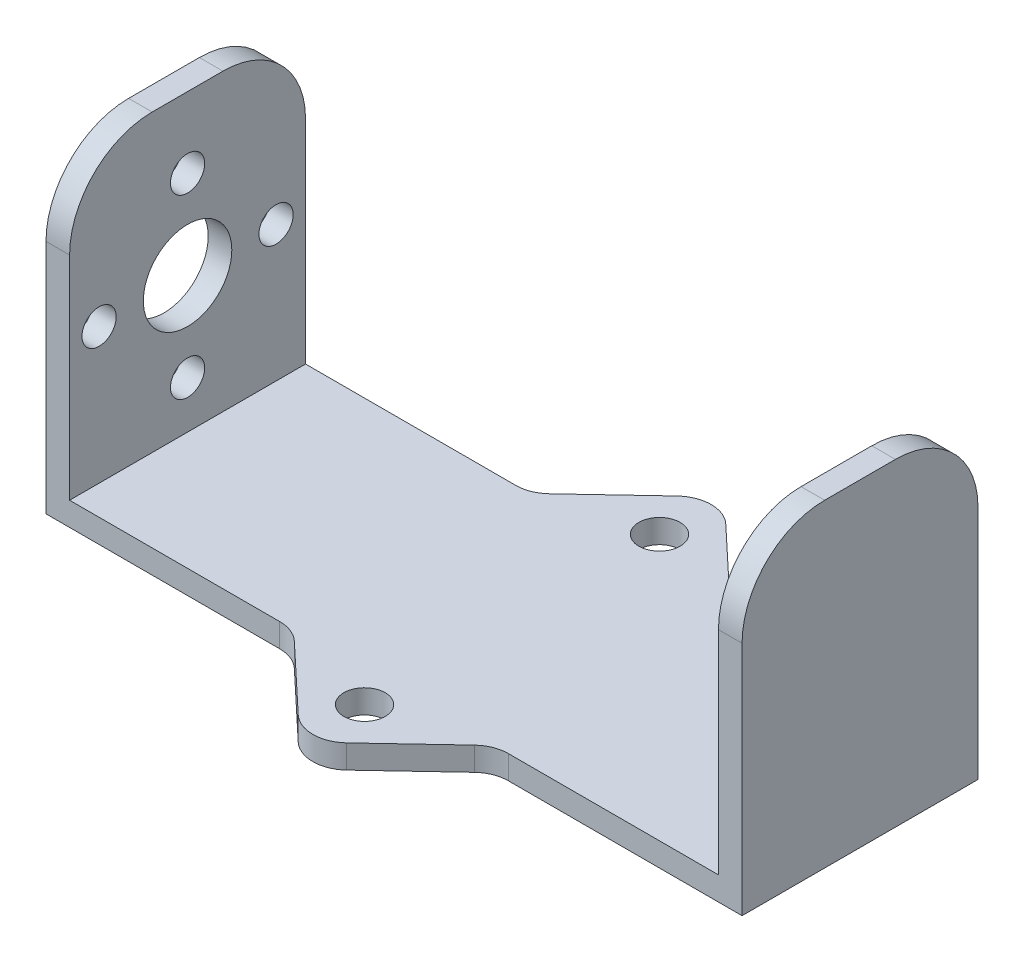
ISO-10303-21;
HEADER;
FILE_DESCRIPTION(('STEP AP214'),'2;1');
FILE_NAME('part.step','',(''),(''),'','','');
FILE_SCHEMA(('AUTOMOTIVE_DESIGN { 1 0 10303 214 1 1 1 1 }'));
ENDSEC;
DATA;
#1=APPLICATION_CONTEXT('core data for automotive mechanical design processes');
#2=APPLICATION_PROTOCOL_DEFINITION('international standard','automotive_design',2000,#1);
#3=PRODUCT_CONTEXT('',#1,'mechanical');
#4=PRODUCT('Part','Part','',(#3));
#5=PRODUCT_RELATED_PRODUCT_CATEGORY('part','',(#4));
#6=PRODUCT_DEFINITION_FORMATION('','',#4);
#7=PRODUCT_DEFINITION_CONTEXT('part definition',#1,'design');
#8=PRODUCT_DEFINITION('design','',#6,#7);
#9=PRODUCT_DEFINITION_SHAPE('','',#8);
#10=(LENGTH_UNIT() NAMED_UNIT(*) SI_UNIT(.MILLI.,.METRE.));
#11=(NAMED_UNIT(*) PLANE_ANGLE_UNIT() SI_UNIT($,.RADIAN.));
#12=(NAMED_UNIT(*) SI_UNIT($,.STERADIAN.) SOLID_ANGLE_UNIT());
#13=UNCERTAINTY_MEASURE_WITH_UNIT(LENGTH_MEASURE(1.E-05),#10,'distance_accuracy_value','');
#14=(GEOMETRIC_REPRESENTATION_CONTEXT(3) GLOBAL_UNCERTAINTY_ASSIGNED_CONTEXT((#13)) GLOBAL_UNIT_ASSIGNED_CONTEXT((#10,
#11,#12)) REPRESENTATION_CONTEXT('',''));
#15=CARTESIAN_POINT('',(0.,0.,0.));
#16=DIRECTION('',(0.,0.,1.));
#17=DIRECTION('',(1.,0.,0.));
#18=AXIS2_PLACEMENT_3D('',#15,#16,#17);
#19=CARTESIAN_POINT('',(0.,0.,10.));
#20=DIRECTION('',(0.,0.,-1.));
#21=DIRECTION('',(-1.,0.,0.));
#22=AXIS2_PLACEMENT_3D('',#19,#20,#21);
#23=PLANE('',#22);
#24=DIRECTION('',(-1.,0.,0.));
#25=VECTOR('',#24,1.);
#26=CARTESIAN_POINT('',(-27.5,0.,10.));
#27=LINE('',#26,#25);
#28=CARTESIAN_POINT('',(27.5,0.,10.));
#29=VERTEX_POINT('',#28);
#30=CARTESIAN_POINT('',(9.68973157372328,0.,10.));
#31=VERTEX_POINT('',#30);
#32=EDGE_CURVE('E230',#29,#31,#27,.T.);
#33=ORIENTED_EDGE('',*,*,#32,.T.);
#34=DIRECTION('',(0.,1.,0.));
#35=VECTOR('',#34,1.);
#36=CARTESIAN_POINT('',(9.68973157372328,0.,10.));
#37=LINE('',#36,#35);
#38=CARTESIAN_POINT('',(9.68973157372329,-2.,10.));
#39=VERTEX_POINT('',#38);
#40=EDGE_CURVE('E328',#31,#39,#37,.F.);
#41=ORIENTED_EDGE('',*,*,#40,.T.);
#42=DIRECTION('',(1.,0.,0.));
#43=VECTOR('',#42,1.);
#44=CARTESIAN_POINT('',(29.5,-1.99999999999999,10.));
#45=LINE('',#44,#43);
#46=CARTESIAN_POINT('',(29.5,-1.99999999999999,10.));
#47=VERTEX_POINT('',#46);
#48=EDGE_CURVE('E205',#39,#47,#45,.T.);
#49=ORIENTED_EDGE('',*,*,#48,.T.);
#50=DIRECTION('',(0.,1.,0.));
#51=VECTOR('',#50,1.);
#52=CARTESIAN_POINT('',(29.5,-1.99999999999999,10.));
#53=LINE('',#52,#51);
#54=CARTESIAN_POINT('',(29.5,18.,10.));
#55=VERTEX_POINT('',#54);
#56=EDGE_CURVE('E221',#47,#55,#53,.T.);
#57=ORIENTED_EDGE('',*,*,#56,.T.);
#58=DIRECTION('',(-1.,0.,0.));
#59=VECTOR('',#58,1.);
#60=CARTESIAN_POINT('',(0.,18.,10.));
#61=LINE('',#60,#59);
#62=CARTESIAN_POINT('',(27.5,18.,10.));
#63=VERTEX_POINT('',#62);
#64=EDGE_CURVE('E287',#55,#63,#61,.T.);
#65=ORIENTED_EDGE('',*,*,#64,.T.);
#66=DIRECTION('',(0.,-1.,0.));
#67=VECTOR('',#66,1.);
#68=CARTESIAN_POINT('',(27.5,25.,10.));
#69=LINE('',#68,#67);
#70=EDGE_CURVE('E224',#63,#29,#69,.T.);
#71=ORIENTED_EDGE('',*,*,#70,.T.);
#72=EDGE_LOOP('',(#33,#41,#49,#57,#65,#71));
#73=FACE_BOUND('',#72,.T.);
#74=ADVANCED_FACE('F33',(#73),#23,.F.);
#75=CARTESIAN_POINT('',(0.,0.,-10.));
#76=DIRECTION('',(0.,0.,-1.));
#77=DIRECTION('',(-1.,0.,0.));
#78=AXIS2_PLACEMENT_3D('',#75,#76,#77);
#79=PLANE('',#78);
#80=DIRECTION('',(-1.,0.,0.));
#81=VECTOR('',#80,1.);
#82=CARTESIAN_POINT('',(-27.5,0.,-10.));
#83=LINE('',#82,#81);
#84=CARTESIAN_POINT('',(-9.68973157372328,0.,-10.));
#85=VERTEX_POINT('',#84);
#86=CARTESIAN_POINT('',(-27.5,0.,-10.));
#87=VERTEX_POINT('',#86);
#88=EDGE_CURVE('E246',#85,#87,#83,.T.);
#89=ORIENTED_EDGE('',*,*,#88,.F.);
#90=DIRECTION('',(0.,1.,0.));
#91=VECTOR('',#90,1.);
#92=CARTESIAN_POINT('',(-9.68973157372328,-2.00000000000001,-10.));
#93=LINE('',#92,#91);
#94=CARTESIAN_POINT('',(-9.68973157372327,-2.,-10.));
#95=VERTEX_POINT('',#94);
#96=EDGE_CURVE('E358',#85,#95,#93,.F.);
#97=ORIENTED_EDGE('',*,*,#96,.T.);
#98=DIRECTION('',(1.,0.,0.));
#99=VECTOR('',#98,1.);
#100=CARTESIAN_POINT('',(29.5,-1.99999999999999,-10.));
#101=LINE('',#100,#99);
#102=CARTESIAN_POINT('',(-29.5,-2.,-10.));
#103=VERTEX_POINT('',#102);
#104=EDGE_CURVE('E239',#103,#95,#101,.T.);
#105=ORIENTED_EDGE('',*,*,#104,.F.);
#106=DIRECTION('',(0.,-1.,0.));
#107=VECTOR('',#106,1.);
#108=CARTESIAN_POINT('',(-29.5,-2.,-10.));
#109=LINE('',#108,#107);
#110=CARTESIAN_POINT('',(-29.5,18.,-10.));
#111=VERTEX_POINT('',#110);
#112=EDGE_CURVE('E213',#111,#103,#109,.T.);
#113=ORIENTED_EDGE('',*,*,#112,.F.);
#114=DIRECTION('',(-1.,0.,0.));
#115=VECTOR('',#114,1.);
#116=CARTESIAN_POINT('',(-27.5,18.,-10.));
#117=LINE('',#116,#115);
#118=CARTESIAN_POINT('',(-27.5,18.,-10.));
#119=VERTEX_POINT('',#118);
#120=EDGE_CURVE('E278',#111,#119,#117,.F.);
#121=ORIENTED_EDGE('',*,*,#120,.T.);
#122=DIRECTION('',(0.,1.,0.));
#123=VECTOR('',#122,1.);
#124=CARTESIAN_POINT('',(-27.5,25.,-10.));
#125=LINE('',#124,#123);
#126=EDGE_CURVE('E206',#87,#119,#125,.T.);
#127=ORIENTED_EDGE('',*,*,#126,.F.);
#128=EDGE_LOOP('',(#89,#97,#105,#113,#121,#127));
#129=FACE_BOUND('',#128,.T.);
#130=ADVANCED_FACE('F382',(#129),#79,.T.);
#131=CARTESIAN_POINT('',(-29.5,25.,10.));
#132=DIRECTION('',(0.,-1.,0.));
#133=DIRECTION('',(0.,0.,-1.));
#134=AXIS2_PLACEMENT_3D('',#131,#132,#133);
#135=PLANE('',#134);
#136=DIRECTION('',(0.,0.,-1.));
#137=VECTOR('',#136,1.);
#138=CARTESIAN_POINT('',(-27.5,25.,10.));
#139=LINE('',#138,#137);
#140=CARTESIAN_POINT('',(-27.5,25.,3.));
#141=VERTEX_POINT('',#140);
#142=CARTESIAN_POINT('',(-27.5,25.,-3.));
#143=VERTEX_POINT('',#142);
#144=EDGE_CURVE('E235',#141,#143,#139,.T.);
#145=ORIENTED_EDGE('',*,*,#144,.T.);
#146=DIRECTION('',(-1.,0.,0.));
#147=VECTOR('',#146,1.);
#148=CARTESIAN_POINT('',(-29.5,25.,-3.));
#149=LINE('',#148,#147);
#150=CARTESIAN_POINT('',(-29.5,25.,-3.));
#151=VERTEX_POINT('',#150);
#152=EDGE_CURVE('E292',#143,#151,#149,.T.);
#153=ORIENTED_EDGE('',*,*,#152,.T.);
#154=DIRECTION('',(0.,0.,-1.));
#155=VECTOR('',#154,1.);
#156=CARTESIAN_POINT('',(-29.5,25.,10.));
#157=LINE('',#156,#155);
#158=CARTESIAN_POINT('',(-29.5,25.,3.));
#159=VERTEX_POINT('',#158);
#160=EDGE_CURVE('E216',#159,#151,#157,.T.);
#161=ORIENTED_EDGE('',*,*,#160,.F.);
#162=DIRECTION('',(-1.,0.,0.));
#163=VECTOR('',#162,1.);
#164=CARTESIAN_POINT('',(-29.5,25.,3.));
#165=LINE('',#164,#163);
#166=EDGE_CURVE('E290',#159,#141,#165,.F.);
#167=ORIENTED_EDGE('',*,*,#166,.T.);
#168=EDGE_LOOP('',(#145,#153,#161,#167));
#169=FACE_BOUND('',#168,.T.);
#170=ADVANCED_FACE('F436',(#169),#135,.F.);
#171=CARTESIAN_POINT('',(-29.5,-2.,10.));
#172=DIRECTION('',(1.,0.,0.));
#173=DIRECTION('',(0.,0.,-1.));
#174=AXIS2_PLACEMENT_3D('',#171,#172,#173);
#175=PLANE('',#174);
#176=CARTESIAN_POINT('',(-29.5,11.5,0.));
#177=DIRECTION('',(1.,0.,0.));
#178=DIRECTION('',(0.,0.,-1.));
#179=AXIS2_PLACEMENT_3D('',#176,#177,#178);
#180=CIRCLE('',#179,3.75);
#181=CARTESIAN_POINT('',(-29.5,11.5,-3.75));
#182=VERTEX_POINT('',#181);
#183=EDGE_CURVE('E319',#182,#182,#180,.T.);
#184=ORIENTED_EDGE('',*,*,#183,.T.);
#185=EDGE_LOOP('',(#184));
#186=FACE_BOUND('',#185,.T.);
#187=CARTESIAN_POINT('',(-29.5,11.5,7.5));
#188=DIRECTION('',(1.,0.,0.));
#189=DIRECTION('',(0.,0.,-1.));
#190=AXIS2_PLACEMENT_3D('',#187,#188,#189);
#191=CIRCLE('',#190,1.45);
#192=CARTESIAN_POINT('',(-29.5,11.5,6.05));
#193=VERTEX_POINT('',#192);
#194=EDGE_CURVE('E315',#193,#193,#191,.T.);
#195=ORIENTED_EDGE('',*,*,#194,.T.);
#196=EDGE_LOOP('',(#195));
#197=FACE_BOUND('',#196,.T.);
#198=CARTESIAN_POINT('',(-29.5,4.,0.));
#199=DIRECTION('',(1.,0.,0.));
#200=DIRECTION('',(0.,0.,-1.));
#201=AXIS2_PLACEMENT_3D('',#198,#199,#200);
#202=CIRCLE('',#201,1.45);
#203=CARTESIAN_POINT('',(-29.5,4.,-1.45));
#204=VERTEX_POINT('',#203);
#205=EDGE_CURVE('E311',#204,#204,#202,.T.);
#206=ORIENTED_EDGE('',*,*,#205,.T.);
#207=EDGE_LOOP('',(#206));
#208=FACE_BOUND('',#207,.T.);
#209=CARTESIAN_POINT('',(-29.5,11.5,-7.5));
#210=DIRECTION('',(1.,0.,0.));
#211=DIRECTION('',(0.,0.,-1.));
#212=AXIS2_PLACEMENT_3D('',#209,#210,#211);
#213=CIRCLE('',#212,1.45);
#214=CARTESIAN_POINT('',(-29.5,11.5,-8.95));
#215=VERTEX_POINT('',#214);
#216=EDGE_CURVE('E307',#215,#215,#213,.T.);
#217=ORIENTED_EDGE('',*,*,#216,.T.);
#218=EDGE_LOOP('',(#217));
#219=FACE_BOUND('',#218,.T.);
#220=CARTESIAN_POINT('',(-29.5,19.,0.));
#221=DIRECTION('',(1.,0.,0.));
#222=DIRECTION('',(0.,0.,-1.));
#223=AXIS2_PLACEMENT_3D('',#220,#221,#222);
#224=CIRCLE('',#223,1.45);
#225=CARTESIAN_POINT('',(-29.5,19.,-1.45));
#226=VERTEX_POINT('',#225);
#227=EDGE_CURVE('E238',#226,#226,#224,.T.);
#228=ORIENTED_EDGE('',*,*,#227,.T.);
#229=EDGE_LOOP('',(#228));
#230=FACE_BOUND('',#229,.T.);
#231=ORIENTED_EDGE('',*,*,#160,.T.);
#232=CARTESIAN_POINT('',(-29.5,18.,-3.));
#233=DIRECTION('',(1.,0.,0.));
#234=DIRECTION('',(0.,0.,-1.));
#235=AXIS2_PLACEMENT_3D('',#232,#233,#234);
#236=CIRCLE('',#235,7.);
#237=EDGE_CURVE('E297',#151,#111,#236,.F.);
#238=ORIENTED_EDGE('',*,*,#237,.T.);
#239=ORIENTED_EDGE('',*,*,#112,.T.);
#240=DIRECTION('',(0.,0.,-1.));
#241=VECTOR('',#240,1.);
#242=CARTESIAN_POINT('',(-29.5,-2.,10.));
#243=LINE('',#242,#241);
#244=CARTESIAN_POINT('',(-29.5,-2.,10.));
#245=VERTEX_POINT('',#244);
#246=EDGE_CURVE('E209',#245,#103,#243,.T.);
#247=ORIENTED_EDGE('',*,*,#246,.F.);
#248=DIRECTION('',(0.,-1.,0.));
#249=VECTOR('',#248,1.);
#250=CARTESIAN_POINT('',(-29.5,-2.,10.));
#251=LINE('',#250,#249);
#252=CARTESIAN_POINT('',(-29.5,18.,10.));
#253=VERTEX_POINT('',#252);
#254=EDGE_CURVE('E195',#253,#245,#251,.T.);
#255=ORIENTED_EDGE('',*,*,#254,.F.);
#256=CARTESIAN_POINT('',(-29.5,18.,3.));
#257=DIRECTION('',(1.,0.,0.));
#258=DIRECTION('',(0.,0.,-1.));
#259=AXIS2_PLACEMENT_3D('',#256,#257,#258);
#260=CIRCLE('',#259,7.);
#261=EDGE_CURVE('E295',#253,#159,#260,.F.);
#262=ORIENTED_EDGE('',*,*,#261,.T.);
#263=EDGE_LOOP('',(#231,#238,#239,#247,#255,#262));
#264=FACE_BOUND('',#263,.T.);
#265=ADVANCED_FACE('F211',(#186,#197,#208,#219,#230,#264),#175,.F.);
#266=CARTESIAN_POINT('',(29.5,-1.99999999999999,10.));
#267=DIRECTION('',(0.,1.,0.));
#268=DIRECTION('',(-1.,0.,0.));
#269=AXIS2_PLACEMENT_3D('',#266,#267,#268);
#270=PLANE('',#269);
#271=CARTESIAN_POINT('',(0.,-2.,12.5));
#272=DIRECTION('',(0.,1.,0.));
#273=DIRECTION('',(-1.,0.,0.));
#274=AXIS2_PLACEMENT_3D('',#271,#272,#273);
#275=CIRCLE('',#274,1.75);
#276=CARTESIAN_POINT('',(-1.75,-2.,12.5));
#277=VERTEX_POINT('',#276);
#278=EDGE_CURVE('E549',#277,#277,#275,.T.);
#279=ORIENTED_EDGE('',*,*,#278,.T.);
#280=EDGE_LOOP('',(#279));
#281=FACE_BOUND('',#280,.T.);
#282=CARTESIAN_POINT('',(0.,-2.,-12.5));
#283=DIRECTION('',(0.,1.,0.));
#284=DIRECTION('',(-1.,0.,0.));
#285=AXIS2_PLACEMENT_3D('',#282,#283,#284);
#286=CIRCLE('',#285,1.75);
#287=CARTESIAN_POINT('',(-1.75,-2.,-12.5));
#288=VERTEX_POINT('',#287);
#289=EDGE_CURVE('E540',#288,#288,#286,.T.);
#290=ORIENTED_EDGE('',*,*,#289,.T.);
#291=EDGE_LOOP('',(#290));
#292=FACE_BOUND('',#291,.T.);
#293=DIRECTION('',(-0.728199992692803,0.,0.685364699004991));
#294=VECTOR('',#293,1.);
#295=CARTESIAN_POINT('',(0.,-2.,18.));
#296=LINE('',#295,#294);
#297=CARTESIAN_POINT('',(7.63363747670831,-2.,10.8154000219216));
#298=VERTEX_POINT('',#297);
#299=CARTESIAN_POINT('',(2.05609409701497,-2.,16.0648526145741));
#300=VERTEX_POINT('',#299);
#301=EDGE_CURVE('E400',#298,#300,#296,.T.);
#302=ORIENTED_EDGE('',*,*,#301,.T.);
#303=CARTESIAN_POINT('',(0.,-2.,13.8802526364957));
#304=DIRECTION('',(0.,1.,0.));
#305=DIRECTION('',(-1.,0.,0.));
#306=AXIS2_PLACEMENT_3D('',#303,#304,#305);
#307=CIRCLE('',#306,3.);
#308=CARTESIAN_POINT('',(-2.05609409701497,-2.,16.0648526145741));
#309=VERTEX_POINT('',#308);
#310=EDGE_CURVE('E341',#300,#309,#307,.F.);
#311=ORIENTED_EDGE('',*,*,#310,.T.);
#312=DIRECTION('',(-0.728199992692803,0.,-0.685364699004991));
#313=VECTOR('',#312,1.);
#314=CARTESIAN_POINT('',(-8.5,-2.,9.99999999999999));
#315=LINE('',#314,#313);
#316=CARTESIAN_POINT('',(-7.6336374767083,-2.,10.8154000219216));
#317=VERTEX_POINT('',#316);
#318=EDGE_CURVE('E541',#309,#317,#315,.T.);
#319=ORIENTED_EDGE('',*,*,#318,.T.);
#320=CARTESIAN_POINT('',(-9.68973157372328,-2.,13.));
#321=DIRECTION('',(0.,1.,0.));
#322=DIRECTION('',(-1.,0.,0.));
#323=AXIS2_PLACEMENT_3D('',#320,#321,#322);
#324=CIRCLE('',#323,3.);
#325=CARTESIAN_POINT('',(-9.68973157372327,-2.,10.));
#326=VERTEX_POINT('',#325);
#327=EDGE_CURVE('E48',#317,#326,#324,.T.);
#328=ORIENTED_EDGE('',*,*,#327,.T.);
#329=EDGE_CURVE('E199',#245,#326,#45,.T.);
#330=ORIENTED_EDGE('',*,*,#329,.F.);
#331=ORIENTED_EDGE('',*,*,#246,.T.);
#332=ORIENTED_EDGE('',*,*,#104,.T.);
#333=CARTESIAN_POINT('',(-9.68973157372328,-2.,-13.));
#334=DIRECTION('',(0.,1.,0.));
#335=DIRECTION('',(-1.,0.,0.));
#336=AXIS2_PLACEMENT_3D('',#333,#334,#335);
#337=CIRCLE('',#336,3.);
#338=CARTESIAN_POINT('',(-7.6336374767083,-2.,-10.8154000219216));
#339=VERTEX_POINT('',#338);
#340=EDGE_CURVE('E11',#95,#339,#337,.T.);
#341=ORIENTED_EDGE('',*,*,#340,.T.);
#342=DIRECTION('',(0.728199992692803,0.,-0.685364699004991));
#343=VECTOR('',#342,1.);
#344=CARTESIAN_POINT('',(-8.5,-2.,-9.99999999999999));
#345=LINE('',#344,#343);
#346=CARTESIAN_POINT('',(-2.05609409701497,-2.,-16.0648526145741));
#347=VERTEX_POINT('',#346);
#348=EDGE_CURVE('E386',#339,#347,#345,.T.);
#349=ORIENTED_EDGE('',*,*,#348,.T.);
#350=CARTESIAN_POINT('',(0.,-2.,-13.8802526364957));
#351=DIRECTION('',(0.,1.,0.));
#352=DIRECTION('',(-1.,0.,0.));
#353=AXIS2_PLACEMENT_3D('',#350,#351,#352);
#354=CIRCLE('',#353,3.);
#355=CARTESIAN_POINT('',(2.05609409701497,-2.,-16.0648526145741));
#356=VERTEX_POINT('',#355);
#357=EDGE_CURVE('E339',#347,#356,#354,.F.);
#358=ORIENTED_EDGE('',*,*,#357,.T.);
#359=DIRECTION('',(0.728199992692803,0.,0.685364699004991));
#360=VECTOR('',#359,1.);
#361=CARTESIAN_POINT('',(0.,-2.,-18.));
#362=LINE('',#361,#360);
#363=CARTESIAN_POINT('',(7.63363747670831,-2.,-10.8154000219216));
#364=VERTEX_POINT('',#363);
#365=EDGE_CURVE('E323',#356,#364,#362,.T.);
#366=ORIENTED_EDGE('',*,*,#365,.T.);
#367=CARTESIAN_POINT('',(9.68973157372328,-2.,-13.));
#368=DIRECTION('',(0.,1.,0.));
#369=DIRECTION('',(-1.,0.,0.));
#370=AXIS2_PLACEMENT_3D('',#367,#368,#369);
#371=CIRCLE('',#370,3.);
#372=CARTESIAN_POINT('',(9.68973157372329,-2.,-10.));
#373=VERTEX_POINT('',#372);
#374=EDGE_CURVE('E55',#364,#373,#371,.T.);
#375=ORIENTED_EDGE('',*,*,#374,.T.);
#376=CARTESIAN_POINT('',(29.5,-1.99999999999999,-10.));
#377=VERTEX_POINT('',#376);
#378=EDGE_CURVE('E237',#373,#377,#101,.T.);
#379=ORIENTED_EDGE('',*,*,#378,.T.);
#380=DIRECTION('',(0.,0.,-1.));
#381=VECTOR('',#380,1.);
#382=CARTESIAN_POINT('',(29.5,-1.99999999999999,10.));
#383=LINE('',#382,#381);
#384=EDGE_CURVE('E217',#47,#377,#383,.T.);
#385=ORIENTED_EDGE('',*,*,#384,.F.);
#386=ORIENTED_EDGE('',*,*,#48,.F.);
#387=CARTESIAN_POINT('',(9.68973157372328,-2.,13.));
#388=DIRECTION('',(0.,1.,0.));
#389=DIRECTION('',(-1.,0.,0.));
#390=AXIS2_PLACEMENT_3D('',#387,#388,#389);
#391=CIRCLE('',#390,3.);
#392=EDGE_CURVE('E362',#39,#298,#391,.T.);
#393=ORIENTED_EDGE('',*,*,#392,.T.);
#394=EDGE_LOOP('',(#302,#311,#319,#328,#330,#331,#332,#341,#349,#358,#366,#375,#379,#385,#386,#393));
#395=FACE_BOUND('',#394,.T.);
#396=ADVANCED_FACE('F220',(#281,#292,#395),#270,.F.);
#397=CARTESIAN_POINT('',(29.5,-1.99999999999999,10.));
#398=DIRECTION('',(-1.,0.,0.));
#399=DIRECTION('',(0.,-1.,0.));
#400=AXIS2_PLACEMENT_3D('',#397,#398,#399);
#401=PLANE('',#400);
#402=DIRECTION('',(0.,1.,0.));
#403=VECTOR('',#402,1.);
#404=CARTESIAN_POINT('',(29.5,-1.99999999999999,-10.));
#405=LINE('',#404,#403);
#406=CARTESIAN_POINT('',(29.5,18.,-10.));
#407=VERTEX_POINT('',#406);
#408=EDGE_CURVE('E241',#377,#407,#405,.T.);
#409=ORIENTED_EDGE('',*,*,#408,.T.);
#410=CARTESIAN_POINT('',(29.5,18.,-3.));
#411=DIRECTION('',(-1.,0.,0.));
#412=DIRECTION('',(0.,-1.,0.));
#413=AXIS2_PLACEMENT_3D('',#410,#411,#412);
#414=CIRCLE('',#413,7.);
#415=CARTESIAN_POINT('',(29.5,25.,-3.));
#416=VERTEX_POINT('',#415);
#417=EDGE_CURVE('E284',#407,#416,#414,.F.);
#418=ORIENTED_EDGE('',*,*,#417,.T.);
#419=DIRECTION('',(0.,0.,-1.));
#420=VECTOR('',#419,1.);
#421=CARTESIAN_POINT('',(29.5,25.,10.));
#422=LINE('',#421,#420);
#423=CARTESIAN_POINT('',(29.5,25.,3.));
#424=VERTEX_POINT('',#423);
#425=EDGE_CURVE('E263',#424,#416,#422,.T.);
#426=ORIENTED_EDGE('',*,*,#425,.F.);
#427=CARTESIAN_POINT('',(29.5,18.,3.));
#428=DIRECTION('',(-1.,0.,0.));
#429=DIRECTION('',(0.,-1.,0.));
#430=AXIS2_PLACEMENT_3D('',#427,#428,#429);
#431=CIRCLE('',#430,7.);
#432=EDGE_CURVE('E282',#424,#55,#431,.F.);
#433=ORIENTED_EDGE('',*,*,#432,.T.);
#434=ORIENTED_EDGE('',*,*,#56,.F.);
#435=ORIENTED_EDGE('',*,*,#384,.T.);
#436=EDGE_LOOP('',(#409,#418,#426,#433,#434,#435));
#437=FACE_BOUND('',#436,.T.);
#438=ADVANCED_FACE('F463',(#437),#401,.F.);
#439=CARTESIAN_POINT('',(29.5,25.,10.));
#440=DIRECTION('',(0.,-1.,0.));
#441=DIRECTION('',(0.,0.,-1.));
#442=AXIS2_PLACEMENT_3D('',#439,#440,#441);
#443=PLANE('',#442);
#444=ORIENTED_EDGE('',*,*,#425,.T.);
#445=DIRECTION('',(-1.,0.,0.));
#446=VECTOR('',#445,1.);
#447=CARTESIAN_POINT('',(27.5,25.,-3.));
#448=LINE('',#447,#446);
#449=CARTESIAN_POINT('',(27.5,25.,-3.));
#450=VERTEX_POINT('',#449);
#451=EDGE_CURVE('E271',#416,#450,#448,.T.);
#452=ORIENTED_EDGE('',*,*,#451,.T.);
#453=DIRECTION('',(0.,0.,-1.));
#454=VECTOR('',#453,1.);
#455=CARTESIAN_POINT('',(27.5,25.,10.));
#456=LINE('',#455,#454);
#457=CARTESIAN_POINT('',(27.5,25.,3.));
#458=VERTEX_POINT('',#457);
#459=EDGE_CURVE('E260',#458,#450,#456,.T.);
#460=ORIENTED_EDGE('',*,*,#459,.F.);
#461=DIRECTION('',(-1.,0.,0.));
#462=VECTOR('',#461,1.);
#463=CARTESIAN_POINT('',(29.5,25.,3.));
#464=LINE('',#463,#462);
#465=EDGE_CURVE('E269',#458,#424,#464,.F.);
#466=ORIENTED_EDGE('',*,*,#465,.T.);
#467=EDGE_LOOP('',(#444,#452,#460,#466));
#468=FACE_BOUND('',#467,.T.);
#469=ADVANCED_FACE('F459',(#468),#443,.F.);
#470=CARTESIAN_POINT('',(27.5,25.,10.));
#471=DIRECTION('',(1.,0.,0.));
#472=DIRECTION('',(0.,1.,0.));
#473=AXIS2_PLACEMENT_3D('',#470,#471,#472);
#474=PLANE('',#473);
#475=ORIENTED_EDGE('',*,*,#459,.T.);
#476=CARTESIAN_POINT('',(27.5,18.,-3.));
#477=DIRECTION('',(1.,0.,0.));
#478=DIRECTION('',(0.,1.,0.));
#479=AXIS2_PLACEMENT_3D('',#476,#477,#478);
#480=CIRCLE('',#479,7.);
#481=CARTESIAN_POINT('',(27.5,18.,-10.));
#482=VERTEX_POINT('',#481);
#483=EDGE_CURVE('E276',#450,#482,#480,.F.);
#484=ORIENTED_EDGE('',*,*,#483,.T.);
#485=DIRECTION('',(0.,-1.,0.));
#486=VECTOR('',#485,1.);
#487=CARTESIAN_POINT('',(27.5,25.,-10.));
#488=LINE('',#487,#486);
#489=CARTESIAN_POINT('',(27.5,0.,-10.));
#490=VERTEX_POINT('',#489);
#491=EDGE_CURVE('E244',#482,#490,#488,.T.);
#492=ORIENTED_EDGE('',*,*,#491,.T.);
#493=DIRECTION('',(0.,0.,-1.));
#494=VECTOR('',#493,1.);
#495=CARTESIAN_POINT('',(27.5,0.,10.));
#496=LINE('',#495,#494);
#497=EDGE_CURVE('E257',#29,#490,#496,.T.);
#498=ORIENTED_EDGE('',*,*,#497,.F.);
#499=ORIENTED_EDGE('',*,*,#70,.F.);
#500=CARTESIAN_POINT('',(27.5,18.,3.));
#501=DIRECTION('',(1.,0.,0.));
#502=DIRECTION('',(0.,1.,0.));
#503=AXIS2_PLACEMENT_3D('',#500,#501,#502);
#504=CIRCLE('',#503,7.);
#505=EDGE_CURVE('E274',#63,#458,#504,.F.);
#506=ORIENTED_EDGE('',*,*,#505,.T.);
#507=EDGE_LOOP('',(#475,#484,#492,#498,#499,#506));
#508=FACE_BOUND('',#507,.T.);
#509=ADVANCED_FACE('F452',(#508),#474,.F.);
#510=CARTESIAN_POINT('',(-27.5,0.,10.));
#511=DIRECTION('',(0.,-1.,0.));
#512=DIRECTION('',(1.,0.,0.));
#513=AXIS2_PLACEMENT_3D('',#510,#511,#512);
#514=PLANE('',#513);
#515=CARTESIAN_POINT('',(0.,0.,12.5));
#516=DIRECTION('',(0.,1.,0.));
#517=DIRECTION('',(-1.,0.,0.));
#518=AXIS2_PLACEMENT_3D('',#515,#516,#517);
#519=CIRCLE('',#518,1.75);
#520=CARTESIAN_POINT('',(-1.75,0.,12.5));
#521=VERTEX_POINT('',#520);
#522=EDGE_CURVE('E551',#521,#521,#519,.T.);
#523=ORIENTED_EDGE('',*,*,#522,.F.);
#524=EDGE_LOOP('',(#523));
#525=FACE_BOUND('',#524,.T.);
#526=CARTESIAN_POINT('',(0.,0.,-12.5));
#527=DIRECTION('',(0.,1.,0.));
#528=DIRECTION('',(-1.,0.,0.));
#529=AXIS2_PLACEMENT_3D('',#526,#527,#528);
#530=CIRCLE('',#529,1.75);
#531=CARTESIAN_POINT('',(-1.75,0.,-12.5));
#532=VERTEX_POINT('',#531);
#533=EDGE_CURVE('E543',#532,#532,#530,.T.);
#534=ORIENTED_EDGE('',*,*,#533,.F.);
#535=EDGE_LOOP('',(#534));
#536=FACE_BOUND('',#535,.T.);
#537=DIRECTION('',(0.728199992692803,0.,0.685364699004991));
#538=VECTOR('',#537,1.);
#539=CARTESIAN_POINT('',(-8.5,0.,10.));
#540=LINE('',#539,#538);
#541=CARTESIAN_POINT('',(-7.6336374767083,0.,10.8154000219216));
#542=VERTEX_POINT('',#541);
#543=CARTESIAN_POINT('',(-2.05609409701498,0.,16.0648526145741));
#544=VERTEX_POINT('',#543);
#545=EDGE_CURVE('E397',#542,#544,#540,.T.);
#546=ORIENTED_EDGE('',*,*,#545,.T.);
#547=CARTESIAN_POINT('',(0.,0.,13.8802526364957));
#548=DIRECTION('',(0.,-1.,0.));
#549=DIRECTION('',(1.,0.,0.));
#550=AXIS2_PLACEMENT_3D('',#547,#548,#549);
#551=CIRCLE('',#550,3.);
#552=CARTESIAN_POINT('',(2.05609409701497,0.,16.0648526145741));
#553=VERTEX_POINT('',#552);
#554=EDGE_CURVE('E337',#544,#553,#551,.F.);
#555=ORIENTED_EDGE('',*,*,#554,.T.);
#556=DIRECTION('',(0.728199992692803,0.,-0.685364699004991));
#557=VECTOR('',#556,1.);
#558=CARTESIAN_POINT('',(0.,0.,18.));
#559=LINE('',#558,#557);
#560=CARTESIAN_POINT('',(7.63363747670831,0.,10.8154000219216));
#561=VERTEX_POINT('',#560);
#562=EDGE_CURVE('E538',#553,#561,#559,.T.);
#563=ORIENTED_EDGE('',*,*,#562,.T.);
#564=CARTESIAN_POINT('',(9.68973157372328,0.,13.));
#565=DIRECTION('',(0.,-1.,0.));
#566=DIRECTION('',(1.,0.,0.));
#567=AXIS2_PLACEMENT_3D('',#564,#565,#566);
#568=CIRCLE('',#567,3.);
#569=EDGE_CURVE('E360',#561,#31,#568,.T.);
#570=ORIENTED_EDGE('',*,*,#569,.T.);
#571=ORIENTED_EDGE('',*,*,#32,.F.);
#572=ORIENTED_EDGE('',*,*,#497,.T.);
#573=CARTESIAN_POINT('',(9.68973157372328,0.,-10.));
#574=VERTEX_POINT('',#573);
#575=EDGE_CURVE('E247',#490,#574,#83,.T.);
#576=ORIENTED_EDGE('',*,*,#575,.T.);
#577=CARTESIAN_POINT('',(9.68973157372328,0.,-13.));
#578=DIRECTION('',(0.,-1.,0.));
#579=DIRECTION('',(1.,0.,0.));
#580=AXIS2_PLACEMENT_3D('',#577,#578,#579);
#581=CIRCLE('',#580,3.);
#582=CARTESIAN_POINT('',(7.63363747670831,0.,-10.8154000219216));
#583=VERTEX_POINT('',#582);
#584=EDGE_CURVE('E367',#574,#583,#581,.T.);
#585=ORIENTED_EDGE('',*,*,#584,.T.);
#586=DIRECTION('',(-0.728199992692803,0.,-0.685364699004991));
#587=VECTOR('',#586,1.);
#588=CARTESIAN_POINT('',(0.,0.,-18.));
#589=LINE('',#588,#587);
#590=CARTESIAN_POINT('',(2.05609409701497,0.,-16.0648526145741));
#591=VERTEX_POINT('',#590);
#592=EDGE_CURVE('E393',#583,#591,#589,.T.);
#593=ORIENTED_EDGE('',*,*,#592,.T.);
#594=CARTESIAN_POINT('',(0.,0.,-13.8802526364957));
#595=DIRECTION('',(0.,-1.,0.));
#596=DIRECTION('',(1.,0.,0.));
#597=AXIS2_PLACEMENT_3D('',#594,#595,#596);
#598=CIRCLE('',#597,3.);
#599=CARTESIAN_POINT('',(-2.05609409701497,0.,-16.0648526145741));
#600=VERTEX_POINT('',#599);
#601=EDGE_CURVE('E335',#591,#600,#598,.F.);
#602=ORIENTED_EDGE('',*,*,#601,.T.);
#603=DIRECTION('',(-0.728199992692803,0.,0.685364699004991));
#604=VECTOR('',#603,1.);
#605=CARTESIAN_POINT('',(-8.5,0.,-10.));
#606=LINE('',#605,#604);
#607=CARTESIAN_POINT('',(-7.6336374767083,0.,-10.8154000219216));
#608=VERTEX_POINT('',#607);
#609=EDGE_CURVE('E376',#600,#608,#606,.T.);
#610=ORIENTED_EDGE('',*,*,#609,.T.);
#611=CARTESIAN_POINT('',(-9.68973157372328,0.,-13.));
#612=DIRECTION('',(0.,-1.,0.));
#613=DIRECTION('',(1.,0.,0.));
#614=AXIS2_PLACEMENT_3D('',#611,#612,#613);
#615=CIRCLE('',#614,3.);
#616=EDGE_CURVE('E41',#608,#85,#615,.T.);
#617=ORIENTED_EDGE('',*,*,#616,.T.);
#618=ORIENTED_EDGE('',*,*,#88,.T.);
#619=DIRECTION('',(0.,0.,-1.));
#620=VECTOR('',#619,1.);
#621=CARTESIAN_POINT('',(-27.5,0.,10.));
#622=LINE('',#621,#620);
#623=CARTESIAN_POINT('',(-27.5,0.,10.));
#624=VERTEX_POINT('',#623);
#625=EDGE_CURVE('E254',#624,#87,#622,.T.);
#626=ORIENTED_EDGE('',*,*,#625,.F.);
#627=CARTESIAN_POINT('',(-9.68973157372328,0.,10.));
#628=VERTEX_POINT('',#627);
#629=EDGE_CURVE('E229',#628,#624,#27,.T.);
#630=ORIENTED_EDGE('',*,*,#629,.F.);
#631=CARTESIAN_POINT('',(-9.68973157372328,0.,13.));
#632=DIRECTION('',(0.,-1.,0.));
#633=DIRECTION('',(1.,0.,0.));
#634=AXIS2_PLACEMENT_3D('',#631,#632,#633);
#635=CIRCLE('',#634,3.);
#636=EDGE_CURVE('E364',#628,#542,#635,.T.);
#637=ORIENTED_EDGE('',*,*,#636,.T.);
#638=EDGE_LOOP('',(#546,#555,#563,#570,#571,#572,#576,#585,#593,#602,#610,#617,#618,#626,#630,#637));
#639=FACE_BOUND('',#638,.T.);
#640=ADVANCED_FACE('F373',(#525,#536,#639),#514,.F.);
#641=CARTESIAN_POINT('',(-27.5,25.,10.));
#642=DIRECTION('',(-1.,0.,0.));
#643=DIRECTION('',(0.,-1.,0.));
#644=AXIS2_PLACEMENT_3D('',#641,#642,#643);
#645=PLANE('',#644);
#646=CARTESIAN_POINT('',(-27.5,11.5,0.));
#647=DIRECTION('',(-1.,0.,0.));
#648=DIRECTION('',(0.,-1.,0.));
#649=AXIS2_PLACEMENT_3D('',#646,#647,#648);
#650=CIRCLE('',#649,3.75);
#651=CARTESIAN_POINT('',(-27.5,7.75,0.));
#652=VERTEX_POINT('',#651);
#653=EDGE_CURVE('E320',#652,#652,#650,.T.);
#654=ORIENTED_EDGE('',*,*,#653,.T.);
#655=EDGE_LOOP('',(#654));
#656=FACE_BOUND('',#655,.T.);
#657=CARTESIAN_POINT('',(-27.5,11.5,7.5));
#658=DIRECTION('',(-1.,0.,0.));
#659=DIRECTION('',(0.,-1.,0.));
#660=AXIS2_PLACEMENT_3D('',#657,#658,#659);
#661=CIRCLE('',#660,1.45);
#662=CARTESIAN_POINT('',(-27.5,10.05,7.5));
#663=VERTEX_POINT('',#662);
#664=EDGE_CURVE('E316',#663,#663,#661,.T.);
#665=ORIENTED_EDGE('',*,*,#664,.T.);
#666=EDGE_LOOP('',(#665));
#667=FACE_BOUND('',#666,.T.);
#668=CARTESIAN_POINT('',(-27.5,4.,0.));
#669=DIRECTION('',(-1.,0.,0.));
#670=DIRECTION('',(0.,-1.,0.));
#671=AXIS2_PLACEMENT_3D('',#668,#669,#670);
#672=CIRCLE('',#671,1.45);
#673=CARTESIAN_POINT('',(-27.5,2.55,0.));
#674=VERTEX_POINT('',#673);
#675=EDGE_CURVE('E312',#674,#674,#672,.T.);
#676=ORIENTED_EDGE('',*,*,#675,.T.);
#677=EDGE_LOOP('',(#676));
#678=FACE_BOUND('',#677,.T.);
#679=CARTESIAN_POINT('',(-27.5,11.5,-7.5));
#680=DIRECTION('',(-1.,0.,0.));
#681=DIRECTION('',(0.,-1.,0.));
#682=AXIS2_PLACEMENT_3D('',#679,#680,#681);
#683=CIRCLE('',#682,1.45);
#684=CARTESIAN_POINT('',(-27.5,10.05,-7.5));
#685=VERTEX_POINT('',#684);
#686=EDGE_CURVE('E308',#685,#685,#683,.T.);
#687=ORIENTED_EDGE('',*,*,#686,.T.);
#688=EDGE_LOOP('',(#687));
#689=FACE_BOUND('',#688,.T.);
#690=CARTESIAN_POINT('',(-27.5,19.,0.));
#691=DIRECTION('',(-1.,0.,0.));
#692=DIRECTION('',(0.,-1.,0.));
#693=AXIS2_PLACEMENT_3D('',#690,#691,#692);
#694=CIRCLE('',#693,1.45);
#695=CARTESIAN_POINT('',(-27.5,17.55,0.));
#696=VERTEX_POINT('',#695);
#697=EDGE_CURVE('E304',#696,#696,#694,.T.);
#698=ORIENTED_EDGE('',*,*,#697,.T.);
#699=EDGE_LOOP('',(#698));
#700=FACE_BOUND('',#699,.T.);
#701=ORIENTED_EDGE('',*,*,#126,.T.);
#702=CARTESIAN_POINT('',(-27.5,18.,-3.));
#703=DIRECTION('',(-1.,0.,0.));
#704=DIRECTION('',(0.,-1.,0.));
#705=AXIS2_PLACEMENT_3D('',#702,#703,#704);
#706=CIRCLE('',#705,7.);
#707=EDGE_CURVE('E301',#119,#143,#706,.F.);
#708=ORIENTED_EDGE('',*,*,#707,.T.);
#709=ORIENTED_EDGE('',*,*,#144,.F.);
#710=CARTESIAN_POINT('',(-27.5,18.,3.));
#711=DIRECTION('',(-1.,0.,0.));
#712=DIRECTION('',(0.,-1.,0.));
#713=AXIS2_PLACEMENT_3D('',#710,#711,#712);
#714=CIRCLE('',#713,7.);
#715=CARTESIAN_POINT('',(-27.5,18.,10.));
#716=VERTEX_POINT('',#715);
#717=EDGE_CURVE('E299',#141,#716,#714,.F.);
#718=ORIENTED_EDGE('',*,*,#717,.T.);
#719=DIRECTION('',(0.,1.,0.));
#720=VECTOR('',#719,1.);
#721=CARTESIAN_POINT('',(-27.5,25.,10.));
#722=LINE('',#721,#720);
#723=EDGE_CURVE('E233',#624,#716,#722,.T.);
#724=ORIENTED_EDGE('',*,*,#723,.F.);
#725=ORIENTED_EDGE('',*,*,#625,.T.);
#726=EDGE_LOOP('',(#701,#708,#709,#718,#724,#725));
#727=FACE_BOUND('',#726,.T.);
#728=ADVANCED_FACE('F440',(#656,#667,#678,#689,#700,#727),#645,.F.);
#729=ORIENTED_EDGE('',*,*,#329,.T.);
#730=DIRECTION('',(0.,1.,0.));
#731=VECTOR('',#730,1.);
#732=CARTESIAN_POINT('',(-9.68973157372328,0.,10.));
#733=LINE('',#732,#731);
#734=EDGE_CURVE('E343',#326,#628,#733,.T.);
#735=ORIENTED_EDGE('',*,*,#734,.T.);
#736=ORIENTED_EDGE('',*,*,#629,.T.);
#737=ORIENTED_EDGE('',*,*,#723,.T.);
#738=DIRECTION('',(-1.,0.,0.));
#739=VECTOR('',#738,1.);
#740=CARTESIAN_POINT('',(0.,18.,10.));
#741=LINE('',#740,#739);
#742=EDGE_CURVE('E203',#716,#253,#741,.T.);
#743=ORIENTED_EDGE('',*,*,#742,.T.);
#744=ORIENTED_EDGE('',*,*,#254,.T.);
#745=EDGE_LOOP('',(#729,#735,#736,#737,#743,#744));
#746=FACE_BOUND('',#745,.T.);
#747=ADVANCED_FACE('F197',(#746),#23,.F.);
#748=ORIENTED_EDGE('',*,*,#378,.F.);
#749=DIRECTION('',(0.,1.,0.));
#750=VECTOR('',#749,1.);
#751=CARTESIAN_POINT('',(9.68973157372328,0.,-10.));
#752=LINE('',#751,#750);
#753=EDGE_CURVE('E355',#373,#574,#752,.T.);
#754=ORIENTED_EDGE('',*,*,#753,.T.);
#755=ORIENTED_EDGE('',*,*,#575,.F.);
#756=ORIENTED_EDGE('',*,*,#491,.F.);
#757=DIRECTION('',(-1.,0.,0.));
#758=VECTOR('',#757,1.);
#759=CARTESIAN_POINT('',(29.5,18.,-10.));
#760=LINE('',#759,#758);
#761=EDGE_CURVE('E280',#482,#407,#760,.F.);
#762=ORIENTED_EDGE('',*,*,#761,.T.);
#763=ORIENTED_EDGE('',*,*,#408,.F.);
#764=EDGE_LOOP('',(#748,#754,#755,#756,#762,#763));
#765=FACE_BOUND('',#764,.T.);
#766=ADVANCED_FACE('F438',(#765),#79,.T.);
#767=CARTESIAN_POINT('',(29.5,18.,-3.));
#768=DIRECTION('',(1.,0.,0.));
#769=DIRECTION('',(0.,0.,-1.));
#770=AXIS2_PLACEMENT_3D('',#767,#768,#769);
#771=CYLINDRICAL_SURFACE('',#770,7.);
#772=ORIENTED_EDGE('',*,*,#417,.F.);
#773=ORIENTED_EDGE('',*,*,#761,.F.);
#774=ORIENTED_EDGE('',*,*,#483,.F.);
#775=ORIENTED_EDGE('',*,*,#451,.F.);
#776=EDGE_LOOP('',(#772,#773,#774,#775));
#777=FACE_BOUND('',#776,.T.);
#778=ADVANCED_FACE('F445',(#777),#771,.T.);
#779=CARTESIAN_POINT('',(0.,18.,3.));
#780=DIRECTION('',(-1.,0.,0.));
#781=DIRECTION('',(0.,0.,1.));
#782=AXIS2_PLACEMENT_3D('',#779,#780,#781);
#783=CYLINDRICAL_SURFACE('',#782,7.);
#784=ORIENTED_EDGE('',*,*,#432,.F.);
#785=ORIENTED_EDGE('',*,*,#465,.F.);
#786=ORIENTED_EDGE('',*,*,#505,.F.);
#787=ORIENTED_EDGE('',*,*,#64,.F.);
#788=EDGE_LOOP('',(#784,#785,#786,#787));
#789=FACE_BOUND('',#788,.T.);
#790=ADVANCED_FACE('F479',(#789),#783,.T.);
#791=CARTESIAN_POINT('',(-29.5,18.,-3.));
#792=DIRECTION('',(1.,0.,0.));
#793=DIRECTION('',(0.,0.,-1.));
#794=AXIS2_PLACEMENT_3D('',#791,#792,#793);
#795=CYLINDRICAL_SURFACE('',#794,7.);
#796=ORIENTED_EDGE('',*,*,#707,.F.);
#797=ORIENTED_EDGE('',*,*,#120,.F.);
#798=ORIENTED_EDGE('',*,*,#237,.F.);
#799=ORIENTED_EDGE('',*,*,#152,.F.);
#800=EDGE_LOOP('',(#796,#797,#798,#799));
#801=FACE_BOUND('',#800,.T.);
#802=ADVANCED_FACE('F426',(#801),#795,.T.);
#803=CARTESIAN_POINT('',(0.,18.,3.));
#804=DIRECTION('',(-1.,0.,0.));
#805=DIRECTION('',(0.,0.,1.));
#806=AXIS2_PLACEMENT_3D('',#803,#804,#805);
#807=CYLINDRICAL_SURFACE('',#806,7.);
#808=ORIENTED_EDGE('',*,*,#717,.F.);
#809=ORIENTED_EDGE('',*,*,#166,.F.);
#810=ORIENTED_EDGE('',*,*,#261,.F.);
#811=ORIENTED_EDGE('',*,*,#742,.F.);
#812=EDGE_LOOP('',(#808,#809,#810,#811));
#813=FACE_BOUND('',#812,.T.);
#814=ADVANCED_FACE('F416',(#813),#807,.T.);
#815=CARTESIAN_POINT('',(-42.5,19.,0.));
#816=DIRECTION('',(1.,0.,0.));
#817=DIRECTION('',(0.,1.,0.));
#818=AXIS2_PLACEMENT_3D('',#815,#816,#817);
#819=CYLINDRICAL_SURFACE('',#818,1.45);
#820=ORIENTED_EDGE('',*,*,#697,.F.);
#821=EDGE_LOOP('',(#820));
#822=FACE_BOUND('',#821,.T.);
#823=ORIENTED_EDGE('',*,*,#227,.F.);
#824=EDGE_LOOP('',(#823));
#825=FACE_BOUND('',#824,.T.);
#826=ADVANCED_FACE('F413',(#822,#825),#819,.F.);
#827=CARTESIAN_POINT('',(-42.5,11.5,-7.5));
#828=DIRECTION('',(1.,0.,0.));
#829=DIRECTION('',(0.,1.,0.));
#830=AXIS2_PLACEMENT_3D('',#827,#828,#829);
#831=CYLINDRICAL_SURFACE('',#830,1.45);
#832=ORIENTED_EDGE('',*,*,#686,.F.);
#833=EDGE_LOOP('',(#832));
#834=FACE_BOUND('',#833,.T.);
#835=ORIENTED_EDGE('',*,*,#216,.F.);
#836=EDGE_LOOP('',(#835));
#837=FACE_BOUND('',#836,.T.);
#838=ADVANCED_FACE('F415',(#834,#837),#831,.F.);
#839=CARTESIAN_POINT('',(-42.5,4.,0.));
#840=DIRECTION('',(1.,0.,0.));
#841=DIRECTION('',(0.,1.,0.));
#842=AXIS2_PLACEMENT_3D('',#839,#840,#841);
#843=CYLINDRICAL_SURFACE('',#842,1.45);
#844=ORIENTED_EDGE('',*,*,#675,.F.);
#845=EDGE_LOOP('',(#844));
#846=FACE_BOUND('',#845,.T.);
#847=ORIENTED_EDGE('',*,*,#205,.F.);
#848=EDGE_LOOP('',(#847));
#849=FACE_BOUND('',#848,.T.);
#850=ADVANCED_FACE('F423',(#846,#849),#843,.F.);
#851=CARTESIAN_POINT('',(-42.5,11.5,7.5));
#852=DIRECTION('',(1.,0.,0.));
#853=DIRECTION('',(0.,1.,0.));
#854=AXIS2_PLACEMENT_3D('',#851,#852,#853);
#855=CYLINDRICAL_SURFACE('',#854,1.45);
#856=ORIENTED_EDGE('',*,*,#664,.F.);
#857=EDGE_LOOP('',(#856));
#858=FACE_BOUND('',#857,.T.);
#859=ORIENTED_EDGE('',*,*,#194,.F.);
#860=EDGE_LOOP('',(#859));
#861=FACE_BOUND('',#860,.T.);
#862=ADVANCED_FACE('F587',(#858,#861),#855,.F.);
#863=CARTESIAN_POINT('',(-42.5,11.5,0.));
#864=DIRECTION('',(1.,0.,0.));
#865=DIRECTION('',(0.,1.,0.));
#866=AXIS2_PLACEMENT_3D('',#863,#864,#865);
#867=CYLINDRICAL_SURFACE('',#866,3.75);
#868=ORIENTED_EDGE('',*,*,#653,.F.);
#869=EDGE_LOOP('',(#868));
#870=FACE_BOUND('',#869,.T.);
#871=ORIENTED_EDGE('',*,*,#183,.F.);
#872=EDGE_LOOP('',(#871));
#873=FACE_BOUND('',#872,.T.);
#874=ADVANCED_FACE('F581',(#870,#873),#867,.F.);
#875=CARTESIAN_POINT('',(-8.5,-20.7882942280559,-10.));
#876=DIRECTION('',(-0.685364699004991,0.,-0.728199992692803));
#877=DIRECTION('',(-0.728199992692803,0.,0.685364699004991));
#878=AXIS2_PLACEMENT_3D('',#875,#876,#877);
#879=PLANE('',#878);
#880=ORIENTED_EDGE('',*,*,#609,.F.);
#881=DIRECTION('',(0.,1.,0.));
#882=VECTOR('',#881,1.);
#883=CARTESIAN_POINT('',(-2.05609409701497,-20.7882942280559,-16.0648526145741));
#884=LINE('',#883,#882);
#885=EDGE_CURVE('E353',#600,#347,#884,.F.);
#886=ORIENTED_EDGE('',*,*,#885,.T.);
#887=ORIENTED_EDGE('',*,*,#348,.F.);
#888=DIRECTION('',(0.,1.,0.));
#889=VECTOR('',#888,1.);
#890=CARTESIAN_POINT('',(-7.6336374767083,0.,-10.8154000219216));
#891=LINE('',#890,#889);
#892=EDGE_CURVE('E350',#339,#608,#891,.T.);
#893=ORIENTED_EDGE('',*,*,#892,.T.);
#894=EDGE_LOOP('',(#880,#886,#887,#893));
#895=FACE_BOUND('',#894,.T.);
#896=ADVANCED_FACE('F389',(#895),#879,.T.);
#897=CARTESIAN_POINT('',(0.,-20.7882942280559,-18.));
#898=DIRECTION('',(0.685364699004991,0.,-0.728199992692803));
#899=DIRECTION('',(-0.728199992692803,0.,-0.685364699004991));
#900=AXIS2_PLACEMENT_3D('',#897,#898,#899);
#901=PLANE('',#900);
#902=ORIENTED_EDGE('',*,*,#365,.F.);
#903=DIRECTION('',(0.,1.,0.));
#904=VECTOR('',#903,1.);
#905=CARTESIAN_POINT('',(2.05609409701497,-20.7882942280559,-16.0648526145741));
#906=LINE('',#905,#904);
#907=EDGE_CURVE('E347',#356,#591,#906,.T.);
#908=ORIENTED_EDGE('',*,*,#907,.T.);
#909=ORIENTED_EDGE('',*,*,#592,.F.);
#910=DIRECTION('',(0.,1.,0.));
#911=VECTOR('',#910,1.);
#912=CARTESIAN_POINT('',(7.63363747670831,-2.,-10.8154000219216));
#913=LINE('',#912,#911);
#914=EDGE_CURVE('E345',#583,#364,#913,.F.);
#915=ORIENTED_EDGE('',*,*,#914,.T.);
#916=EDGE_LOOP('',(#902,#908,#909,#915));
#917=FACE_BOUND('',#916,.T.);
#918=ADVANCED_FACE('F578',(#917),#901,.T.);
#919=CARTESIAN_POINT('',(0.,-20.7882942280559,18.));
#920=DIRECTION('',(0.685364699004991,0.,0.728199992692803));
#921=DIRECTION('',(0.728199992692803,0.,-0.685364699004991));
#922=AXIS2_PLACEMENT_3D('',#919,#920,#921);
#923=PLANE('',#922);
#924=ORIENTED_EDGE('',*,*,#301,.F.);
#925=DIRECTION('',(0.,1.,0.));
#926=VECTOR('',#925,1.);
#927=CARTESIAN_POINT('',(7.63363747670831,-20.7882942280559,10.8154000219216));
#928=LINE('',#927,#926);
#929=EDGE_CURVE('E325',#298,#561,#928,.T.);
#930=ORIENTED_EDGE('',*,*,#929,.T.);
#931=ORIENTED_EDGE('',*,*,#562,.F.);
#932=DIRECTION('',(0.,1.,0.));
#933=VECTOR('',#932,1.);
#934=CARTESIAN_POINT('',(2.05609409701497,-20.7882942280559,16.0648526145741));
#935=LINE('',#934,#933);
#936=EDGE_CURVE('E303',#553,#300,#935,.F.);
#937=ORIENTED_EDGE('',*,*,#936,.T.);
#938=EDGE_LOOP('',(#924,#930,#931,#937));
#939=FACE_BOUND('',#938,.T.);
#940=ADVANCED_FACE('F537',(#939),#923,.T.);
#941=CARTESIAN_POINT('',(-8.5,-20.7882942280559,10.));
#942=DIRECTION('',(-0.685364699004991,0.,0.728199992692803));
#943=DIRECTION('',(0.728199992692803,0.,0.685364699004991));
#944=AXIS2_PLACEMENT_3D('',#941,#942,#943);
#945=PLANE('',#944);
#946=ORIENTED_EDGE('',*,*,#318,.F.);
#947=DIRECTION('',(0.,1.,0.));
#948=VECTOR('',#947,1.);
#949=CARTESIAN_POINT('',(-2.05609409701498,-20.7882942280559,16.0648526145741));
#950=LINE('',#949,#948);
#951=EDGE_CURVE('E332',#309,#544,#950,.T.);
#952=ORIENTED_EDGE('',*,*,#951,.T.);
#953=ORIENTED_EDGE('',*,*,#545,.F.);
#954=DIRECTION('',(0.,1.,0.));
#955=VECTOR('',#954,1.);
#956=CARTESIAN_POINT('',(-7.6336374767083,-20.7882942280559,10.8154000219216));
#957=LINE('',#956,#955);
#958=EDGE_CURVE('E330',#542,#317,#957,.F.);
#959=ORIENTED_EDGE('',*,*,#958,.T.);
#960=EDGE_LOOP('',(#946,#952,#953,#959));
#961=FACE_BOUND('',#960,.T.);
#962=ADVANCED_FACE('F491',(#961),#945,.T.);
#963=CARTESIAN_POINT('',(9.68973157372328,-20.7882942280559,13.));
#964=DIRECTION('',(0.,1.,0.));
#965=DIRECTION('',(-1.,0.,0.));
#966=AXIS2_PLACEMENT_3D('',#963,#964,#965);
#967=CYLINDRICAL_SURFACE('',#966,3.);
#968=ORIENTED_EDGE('',*,*,#392,.F.);
#969=ORIENTED_EDGE('',*,*,#40,.F.);
#970=ORIENTED_EDGE('',*,*,#569,.F.);
#971=ORIENTED_EDGE('',*,*,#929,.F.);
#972=EDGE_LOOP('',(#968,#969,#970,#971));
#973=FACE_BOUND('',#972,.T.);
#974=ADVANCED_FACE('F487',(#973),#967,.F.);
#975=CARTESIAN_POINT('',(0.,-20.7882942280559,13.8802526364957));
#976=DIRECTION('',(0.,1.,0.));
#977=DIRECTION('',(-1.,0.,0.));
#978=AXIS2_PLACEMENT_3D('',#975,#976,#977);
#979=CYLINDRICAL_SURFACE('',#978,3.);
#980=ORIENTED_EDGE('',*,*,#310,.F.);
#981=ORIENTED_EDGE('',*,*,#936,.F.);
#982=ORIENTED_EDGE('',*,*,#554,.F.);
#983=ORIENTED_EDGE('',*,*,#951,.F.);
#984=EDGE_LOOP('',(#980,#981,#982,#983));
#985=FACE_BOUND('',#984,.T.);
#986=ADVANCED_FACE('F490',(#985),#979,.T.);
#987=CARTESIAN_POINT('',(-9.68973157372328,0.,13.));
#988=DIRECTION('',(0.,1.,0.));
#989=DIRECTION('',(-1.,0.,0.));
#990=AXIS2_PLACEMENT_3D('',#987,#988,#989);
#991=CYLINDRICAL_SURFACE('',#990,3.);
#992=ORIENTED_EDGE('',*,*,#327,.F.);
#993=ORIENTED_EDGE('',*,*,#958,.F.);
#994=ORIENTED_EDGE('',*,*,#636,.F.);
#995=ORIENTED_EDGE('',*,*,#734,.F.);
#996=EDGE_LOOP('',(#992,#993,#994,#995));
#997=FACE_BOUND('',#996,.T.);
#998=ADVANCED_FACE('F495',(#997),#991,.F.);
#999=CARTESIAN_POINT('',(0.,-20.7882942280559,-13.8802526364957));
#1000=DIRECTION('',(0.,1.,0.));
#1001=DIRECTION('',(-1.,0.,0.));
#1002=AXIS2_PLACEMENT_3D('',#999,#1000,#1001);
#1003=CYLINDRICAL_SURFACE('',#1002,3.);
#1004=ORIENTED_EDGE('',*,*,#357,.F.);
#1005=ORIENTED_EDGE('',*,*,#885,.F.);
#1006=ORIENTED_EDGE('',*,*,#601,.F.);
#1007=ORIENTED_EDGE('',*,*,#907,.F.);
#1008=EDGE_LOOP('',(#1004,#1005,#1006,#1007));
#1009=FACE_BOUND('',#1008,.T.);
#1010=ADVANCED_FACE('F499',(#1009),#1003,.T.);
#1011=CARTESIAN_POINT('',(9.68973157372328,0.,-13.));
#1012=DIRECTION('',(0.,-1.,0.));
#1013=DIRECTION('',(1.,0.,0.));
#1014=AXIS2_PLACEMENT_3D('',#1011,#1012,#1013);
#1015=CYLINDRICAL_SURFACE('',#1014,3.);
#1016=ORIENTED_EDGE('',*,*,#374,.F.);
#1017=ORIENTED_EDGE('',*,*,#914,.F.);
#1018=ORIENTED_EDGE('',*,*,#584,.F.);
#1019=ORIENTED_EDGE('',*,*,#753,.F.);
#1020=EDGE_LOOP('',(#1016,#1017,#1018,#1019));
#1021=FACE_BOUND('',#1020,.T.);
#1022=ADVANCED_FACE('F502',(#1021),#1015,.F.);
#1023=CARTESIAN_POINT('',(-9.68973157372328,-20.7882942280559,-13.));
#1024=DIRECTION('',(0.,-1.,0.));
#1025=DIRECTION('',(1.,0.,0.));
#1026=AXIS2_PLACEMENT_3D('',#1023,#1024,#1025);
#1027=CYLINDRICAL_SURFACE('',#1026,3.);
#1028=ORIENTED_EDGE('',*,*,#340,.F.);
#1029=ORIENTED_EDGE('',*,*,#96,.F.);
#1030=ORIENTED_EDGE('',*,*,#616,.F.);
#1031=ORIENTED_EDGE('',*,*,#892,.F.);
#1032=EDGE_LOOP('',(#1028,#1029,#1030,#1031));
#1033=FACE_BOUND('',#1032,.T.);
#1034=ADVANCED_FACE('F35',(#1033),#1027,.F.);
#1035=CARTESIAN_POINT('',(0.,-2.,-12.5));
#1036=DIRECTION('',(0.,1.,0.));
#1037=DIRECTION('',(-1.,0.,0.));
#1038=AXIS2_PLACEMENT_3D('',#1035,#1036,#1037);
#1039=CYLINDRICAL_SURFACE('',#1038,1.75);
#1040=ORIENTED_EDGE('',*,*,#289,.F.);
#1041=EDGE_LOOP('',(#1040));
#1042=FACE_BOUND('',#1041,.T.);
#1043=ORIENTED_EDGE('',*,*,#533,.T.);
#1044=EDGE_LOOP('',(#1043));
#1045=FACE_BOUND('',#1044,.T.);
#1046=ADVANCED_FACE('F509',(#1042,#1045),#1039,.F.);
#1047=CARTESIAN_POINT('',(0.,-2.,12.5));
#1048=DIRECTION('',(0.,1.,0.));
#1049=DIRECTION('',(-1.,0.,0.));
#1050=AXIS2_PLACEMENT_3D('',#1047,#1048,#1049);
#1051=CYLINDRICAL_SURFACE('',#1050,1.75);
#1052=ORIENTED_EDGE('',*,*,#278,.F.);
#1053=EDGE_LOOP('',(#1052));
#1054=FACE_BOUND('',#1053,.T.);
#1055=ORIENTED_EDGE('',*,*,#522,.T.);
#1056=EDGE_LOOP('',(#1055));
#1057=FACE_BOUND('',#1056,.T.);
#1058=ADVANCED_FACE('F558',(#1054,#1057),#1051,.F.);
#1059=CLOSED_SHELL('',(#74,#130,#170,#265,#396,#438,#469,#509,#640,#728,#747,#766,#778,#790,
#802,#814,#826,#838,#850,#862,#874,#896,#918,#940,#962,#974,#986,#998,#1010,#1022,#1034,#1046,#1058));
#1060=MANIFOLD_SOLID_BREP('B2',#1059);
#1061=ADVANCED_BREP_SHAPE_REPRESENTATION('',(#18,#1060),#14);
#1062=SHAPE_DEFINITION_REPRESENTATION(#9,#1061);
ENDSEC;
END-ISO-10303-21;
